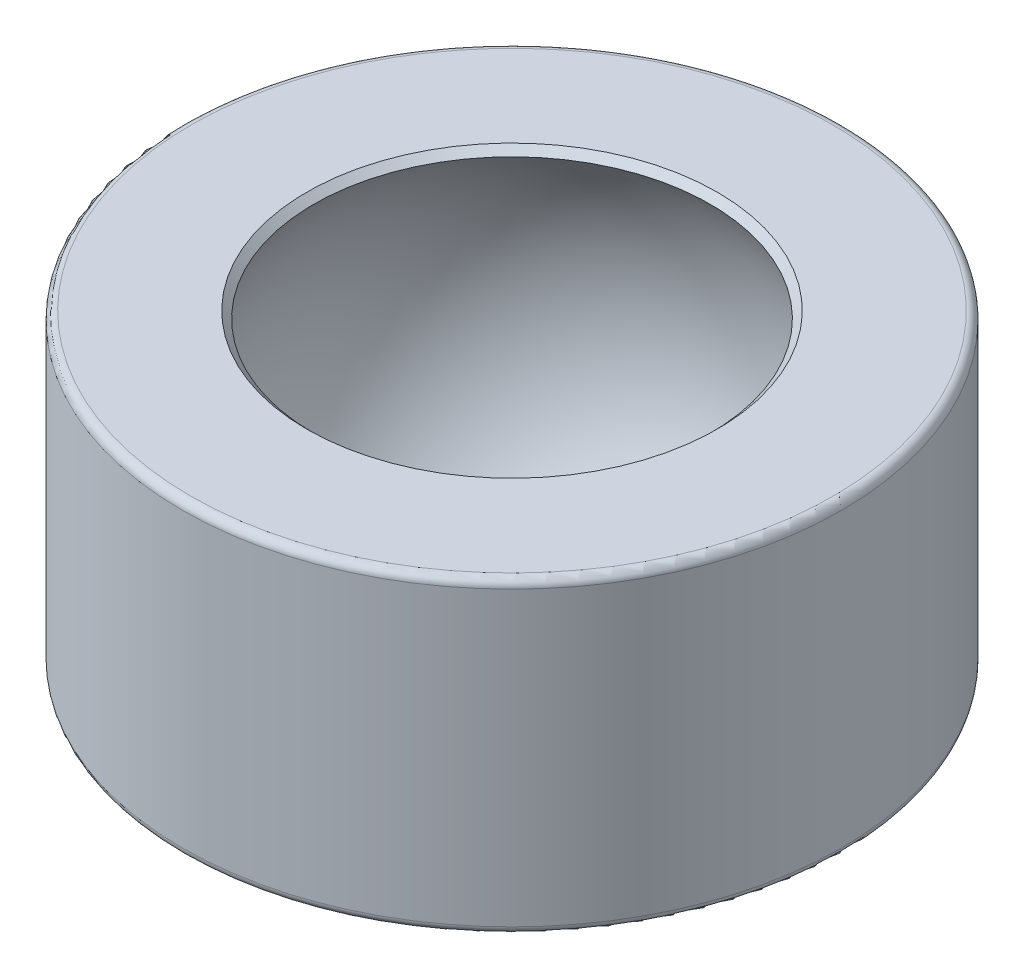
ISO-10303-21;
HEADER;
FILE_DESCRIPTION(('STEP AP214'),'2;1');
FILE_NAME('part.step','',(''),(''),'','','');
FILE_SCHEMA(('AUTOMOTIVE_DESIGN { 1 0 10303 214 1 1 1 1 }'));
ENDSEC;
DATA;
#1=APPLICATION_CONTEXT('core data for automotive mechanical design processes');
#2=APPLICATION_PROTOCOL_DEFINITION('international standard','automotive_design',2000,#1);
#3=PRODUCT_CONTEXT('',#1,'mechanical');
#4=PRODUCT('Part','Part','',(#3));
#5=PRODUCT_RELATED_PRODUCT_CATEGORY('part','',(#4));
#6=PRODUCT_DEFINITION_FORMATION('','',#4);
#7=PRODUCT_DEFINITION_CONTEXT('part definition',#1,'design');
#8=PRODUCT_DEFINITION('design','',#6,#7);
#9=PRODUCT_DEFINITION_SHAPE('','',#8);
#10=(LENGTH_UNIT() NAMED_UNIT(*) SI_UNIT(.MILLI.,.METRE.));
#11=(NAMED_UNIT(*) PLANE_ANGLE_UNIT() SI_UNIT($,.RADIAN.));
#12=(NAMED_UNIT(*) SI_UNIT($,.STERADIAN.) SOLID_ANGLE_UNIT());
#13=UNCERTAINTY_MEASURE_WITH_UNIT(LENGTH_MEASURE(1.E-05),#10,'distance_accuracy_value','');
#14=(GEOMETRIC_REPRESENTATION_CONTEXT(3) GLOBAL_UNCERTAINTY_ASSIGNED_CONTEXT((#13)) GLOBAL_UNIT_ASSIGNED_CONTEXT((#10,
#11,#12)) REPRESENTATION_CONTEXT('',''));
#15=CARTESIAN_POINT('',(0.,0.,0.));
#16=DIRECTION('',(0.,0.,1.));
#17=DIRECTION('',(1.,0.,0.));
#18=AXIS2_PLACEMENT_3D('',#15,#16,#17);
#19=CARTESIAN_POINT('',(0.,-1.875,0.));
#20=DIRECTION('',(0.,1.,0.));
#21=DIRECTION('',(0.,0.,1.));
#22=AXIS2_PLACEMENT_3D('',#19,#20,#21);
#23=CYLINDRICAL_SURFACE('',#22,4.);
#24=CARTESIAN_POINT('',(0.,1.775,0.));
#25=DIRECTION('',(0.,1.,0.));
#26=DIRECTION('',(0.,0.,1.));
#27=AXIS2_PLACEMENT_3D('',#24,#25,#26);
#28=CIRCLE('',#27,4.);
#29=CARTESIAN_POINT('',(0.,1.775,4.));
#30=VERTEX_POINT('',#29);
#31=EDGE_CURVE('E68',#30,#30,#28,.F.);
#32=ORIENTED_EDGE('',*,*,#31,.T.);
#33=EDGE_LOOP('',(#32));
#34=FACE_BOUND('',#33,.T.);
#35=CARTESIAN_POINT('',(0.,-1.775,0.));
#36=DIRECTION('',(0.,1.,0.));
#37=DIRECTION('',(0.,0.,1.));
#38=AXIS2_PLACEMENT_3D('',#35,#36,#37);
#39=CIRCLE('',#38,4.);
#40=CARTESIAN_POINT('',(0.,-1.775,4.));
#41=VERTEX_POINT('',#40);
#42=EDGE_CURVE('E71',#41,#41,#39,.T.);
#43=ORIENTED_EDGE('',*,*,#42,.T.);
#44=EDGE_LOOP('',(#43));
#45=FACE_BOUND('',#44,.T.);
#46=ADVANCED_FACE('F44',(#34,#45),#23,.T.);
#47=CARTESIAN_POINT('',(0.,-1.875,0.));
#48=DIRECTION('',(0.,1.,0.));
#49=DIRECTION('',(0.,0.,1.));
#50=AXIS2_PLACEMENT_3D('',#47,#48,#49);
#51=PLANE('',#50);
#52=CARTESIAN_POINT('',(0.,-1.875,0.));
#53=DIRECTION('',(0.,1.,0.));
#54=DIRECTION('',(0.,0.,1.));
#55=AXIS2_PLACEMENT_3D('',#52,#53,#54);
#56=CIRCLE('',#55,2.44858836354783);
#57=CARTESIAN_POINT('',(0.,-1.875,2.44858836354783));
#58=VERTEX_POINT('',#57);
#59=EDGE_CURVE('E10',#58,#58,#56,.T.);
#60=ORIENTED_EDGE('',*,*,#59,.T.);
#61=EDGE_LOOP('',(#60));
#62=FACE_BOUND('',#61,.T.);
#63=CARTESIAN_POINT('',(0.,-1.875,0.));
#64=DIRECTION('',(0.,1.,0.));
#65=DIRECTION('',(0.,0.,1.));
#66=AXIS2_PLACEMENT_3D('',#63,#64,#65);
#67=CIRCLE('',#66,3.9);
#68=CARTESIAN_POINT('',(0.,-1.875,3.9));
#69=VERTEX_POINT('',#68);
#70=EDGE_CURVE('E65',#69,#69,#67,.F.);
#71=ORIENTED_EDGE('',*,*,#70,.T.);
#72=EDGE_LOOP('',(#71));
#73=FACE_BOUND('',#72,.T.);
#74=ADVANCED_FACE('F98',(#62,#73),#51,.F.);
#75=CARTESIAN_POINT('',(0.,1.875,0.));
#76=DIRECTION('',(0.,1.,0.));
#77=DIRECTION('',(0.,0.,1.));
#78=AXIS2_PLACEMENT_3D('',#75,#76,#77);
#79=PLANE('',#78);
#80=CARTESIAN_POINT('',(0.,1.875,0.));
#81=DIRECTION('',(0.,1.,0.));
#82=DIRECTION('',(0.,0.,1.));
#83=AXIS2_PLACEMENT_3D('',#80,#81,#82);
#84=CIRCLE('',#83,2.4918742493994);
#85=CARTESIAN_POINT('',(0.,1.875,2.4918742493994));
#86=VERTEX_POINT('',#85);
#87=EDGE_CURVE('E52',#86,#86,#84,.F.);
#88=ORIENTED_EDGE('',*,*,#87,.T.);
#89=EDGE_LOOP('',(#88));
#90=FACE_BOUND('',#89,.T.);
#91=CARTESIAN_POINT('',(0.,1.875,0.));
#92=DIRECTION('',(0.,1.,0.));
#93=DIRECTION('',(0.,0.,1.));
#94=AXIS2_PLACEMENT_3D('',#91,#92,#93);
#95=CIRCLE('',#94,3.9);
#96=CARTESIAN_POINT('',(0.,1.875,3.9));
#97=VERTEX_POINT('',#96);
#98=EDGE_CURVE('E74',#97,#97,#95,.T.);
#99=ORIENTED_EDGE('',*,*,#98,.T.);
#100=EDGE_LOOP('',(#99));
#101=FACE_BOUND('',#100,.T.);
#102=ADVANCED_FACE('F78',(#90,#101),#79,.T.);
#103=CARTESIAN_POINT('',(0.,0.,0.));
#104=DIRECTION('',(0.,0.,-1.));
#105=DIRECTION('',(1.,0.,0.));
#106=AXIS2_PLACEMENT_3D('',#103,#104,#105);
#107=SPHERICAL_SURFACE('',#106,3.);
#108=CARTESIAN_POINT('',(0.,0.,0.));
#109=DIRECTION('',(0.,-1.,0.));
#110=DIRECTION('',(0.,0.,-1.));
#111=AXIS2_PLACEMENT_3D('',#108,#109,#110);
#112=SPHERICAL_SURFACE('',#111,3.);
#113=CARTESIAN_POINT('',(0.,1.79034026704698,0.));
#114=DIRECTION('',(0.,-1.,0.));
#115=DIRECTION('',(0.,0.,-1.));
#116=AXIS2_PLACEMENT_3D('',#113,#114,#115);
#117=CIRCLE('',#116,2.40721451644638);
#118=CARTESIAN_POINT('',(0.,1.79034026704698,2.40721451644638));
#119=VERTEX_POINT('',#118);
#120=EDGE_CURVE('E56',#119,#119,#117,.F.);
#121=ORIENTED_EDGE('',*,*,#120,.T.);
#122=EDGE_LOOP('',(#121));
#123=FACE_BOUND('',#122,.T.);
#124=CARTESIAN_POINT('',(0.,-1.75235006248991,0.));
#125=DIRECTION('',(0.,1.,0.));
#126=DIRECTION('',(0.,0.,1.));
#127=AXIS2_PLACEMENT_3D('',#124,#125,#126);
#128=CIRCLE('',#127,2.43500908796899);
#129=CARTESIAN_POINT('',(0.,-1.75235006248991,2.43500908796899));
#130=VERTEX_POINT('',#129);
#131=EDGE_CURVE('E60',#130,#130,#128,.F.);
#132=ORIENTED_EDGE('',*,*,#131,.T.);
#133=EDGE_LOOP('',(#132));
#134=FACE_BOUND('',#133,.T.);
#135=ADVANCED_FACE('F83',(#123,#134),#112,.F.);
#136=CARTESIAN_POINT('',(0.,1.775,0.));
#137=DIRECTION('',(0.,1.,0.));
#138=DIRECTION('',(0.,0.,1.));
#139=AXIS2_PLACEMENT_3D('',#136,#137,#138);
#140=TOROIDAL_SURFACE('',#139,3.9,0.1);
#141=ORIENTED_EDGE('',*,*,#31,.F.);
#142=EDGE_LOOP('',(#141));
#143=FACE_BOUND('',#142,.T.);
#144=ORIENTED_EDGE('',*,*,#98,.F.);
#145=EDGE_LOOP('',(#144));
#146=FACE_BOUND('',#145,.T.);
#147=ADVANCED_FACE('F80',(#143,#146),#140,.T.);
#148=CARTESIAN_POINT('',(0.,-1.775,0.));
#149=DIRECTION('',(0.,1.,0.));
#150=DIRECTION('',(0.,0.,1.));
#151=AXIS2_PLACEMENT_3D('',#148,#149,#150);
#152=TOROIDAL_SURFACE('',#151,3.9,0.1);
#153=ORIENTED_EDGE('',*,*,#70,.F.);
#154=EDGE_LOOP('',(#153));
#155=FACE_BOUND('',#154,.T.);
#156=ORIENTED_EDGE('',*,*,#42,.F.);
#157=EDGE_LOOP('',(#156));
#158=FACE_BOUND('',#157,.T.);
#159=ADVANCED_FACE('F82',(#155,#158),#152,.T.);
#160=CARTESIAN_POINT('',(0.,1.79034026704698,0.));
#161=DIRECTION('',(0.,1.,0.));
#162=DIRECTION('',(0.,0.,1.));
#163=AXIS2_PLACEMENT_3D('',#160,#161,#162);
#164=CONICAL_SURFACE('',#163,2.40721451644638,0.785398163397448);
#165=CARTESIAN_POINT('',(0.,1.875,2.4918742493994));
#166=CARTESIAN_POINT('',(0.,1.87411812778174,2.49099237718114));
#167=CARTESIAN_POINT('',(0.,1.87323625556348,2.49011050496288));
#168=CARTESIAN_POINT('',(0.,1.87147251112696,2.48834676052636));
#169=CARTESIAN_POINT('',(0.,1.8705906389087,2.4874648883081));
#170=CARTESIAN_POINT('',(0.,1.86882689447218,2.48570114387158));
#171=CARTESIAN_POINT('',(0.,1.86794502225391,2.48481927165331));
#172=CARTESIAN_POINT('',(0.,1.86618127781739,2.48305552721679));
#173=CARTESIAN_POINT('',(0.,1.86529940559913,2.48217365499853));
#174=CARTESIAN_POINT('',(0.,1.86353566116261,2.48040991056201));
#175=CARTESIAN_POINT('',(0.,1.86265378894435,2.47952803834375));
#176=CARTESIAN_POINT('',(0.,1.86089004450783,2.47776429390723));
#177=CARTESIAN_POINT('',(0.,1.86000817228957,2.47688242168897));
#178=CARTESIAN_POINT('',(0.,1.85824442785305,2.47511867725245));
#179=CARTESIAN_POINT('',(0.,1.85736255563479,2.47423680503419));
#180=CARTESIAN_POINT('',(0.,1.85559881119827,2.47247306059767));
#181=CARTESIAN_POINT('',(0.,1.85471693898,2.47159118837941));
#182=CARTESIAN_POINT('',(0.,1.85295319454348,2.46982744394288));
#183=CARTESIAN_POINT('',(0.,1.85207132232522,2.46894557172462));
#184=CARTESIAN_POINT('',(0.,1.8503075778887,2.4671818272881));
#185=CARTESIAN_POINT('',(0.,1.84942570567044,2.46629995506984));
#186=CARTESIAN_POINT('',(0.,1.84766196123392,2.46453621063332));
#187=CARTESIAN_POINT('',(0.,1.84678008901566,2.46365433841506));
#188=CARTESIAN_POINT('',(0.,1.84501634457914,2.46189059397854));
#189=CARTESIAN_POINT('',(0.,1.84413447236088,2.46100872176028));
#190=CARTESIAN_POINT('',(0.,1.84237072792436,2.45924497732376));
#191=CARTESIAN_POINT('',(0.,1.84148885570609,2.45836310510549));
#192=CARTESIAN_POINT('',(0.,1.83972511126957,2.45659936066897));
#193=CARTESIAN_POINT('',(0.,1.83884323905131,2.45571748845071));
#194=CARTESIAN_POINT('',(0.,1.83707949461479,2.45395374401419));
#195=CARTESIAN_POINT('',(0.,1.83619762239653,2.45307187179593));
#196=CARTESIAN_POINT('',(0.,1.83443387796001,2.45130812735941));
#197=CARTESIAN_POINT('',(0.,1.83355200574175,2.45042625514115));
#198=CARTESIAN_POINT('',(0.,1.83178826130523,2.44866251070463));
#199=CARTESIAN_POINT('',(0.,1.83090638908697,2.44778063848637));
#200=CARTESIAN_POINT('',(0.,1.82914264465045,2.44601689404985));
#201=CARTESIAN_POINT('',(0.,1.82826077243218,2.44513502183159));
#202=CARTESIAN_POINT('',(0.,1.82649702799566,2.44337127739506));
#203=CARTESIAN_POINT('',(0.,1.8256151557774,2.4424894051768));
#204=CARTESIAN_POINT('',(0.,1.82385141134088,2.44072566074028));
#205=CARTESIAN_POINT('',(0.,1.82296953912262,2.43984378852202));
#206=CARTESIAN_POINT('',(0.,1.8212057946861,2.4380800440855));
#207=CARTESIAN_POINT('',(0.,1.82032392246784,2.43719817186724));
#208=CARTESIAN_POINT('',(0.,1.81856017803132,2.43543442743072));
#209=CARTESIAN_POINT('',(0.,1.81767830581306,2.43455255521246));
#210=CARTESIAN_POINT('',(0.,1.81591456137654,2.43278881077594));
#211=CARTESIAN_POINT('',(0.,1.81503268915827,2.43190693855767));
#212=CARTESIAN_POINT('',(0.,1.81326894472175,2.43014319412115));
#213=CARTESIAN_POINT('',(0.,1.81238707250349,2.42926132190289));
#214=CARTESIAN_POINT('',(0.,1.81062332806697,2.42749757746637));
#215=CARTESIAN_POINT('',(0.,1.80974145584871,2.42661570524811));
#216=CARTESIAN_POINT('',(0.,1.80797771141219,2.42485196081159));
#217=CARTESIAN_POINT('',(0.,1.80709583919393,2.42397008859333));
#218=CARTESIAN_POINT('',(0.,1.80533209475741,2.42220634415681));
#219=CARTESIAN_POINT('',(0.,1.80445022253915,2.42132447193855));
#220=CARTESIAN_POINT('',(0.,1.80268647810263,2.41956072750203));
#221=CARTESIAN_POINT('',(0.,1.80180460588436,2.41867885528377));
#222=CARTESIAN_POINT('',(0.,1.80004086144784,2.41691511084724));
#223=CARTESIAN_POINT('',(0.,1.79915898922958,2.41603323862898));
#224=CARTESIAN_POINT('',(0.,1.79739524479306,2.41426949419246));
#225=CARTESIAN_POINT('',(0.,1.7965133725748,2.4133876219742));
#226=CARTESIAN_POINT('',(0.,1.79474962813828,2.41162387753768));
#227=CARTESIAN_POINT('',(0.,1.79386775592002,2.41074200531942));
#228=CARTESIAN_POINT('',(0.,1.7921040114835,2.4089782608829));
#229=CARTESIAN_POINT('',(0.,1.79122213926524,2.40809638866464));
#230=CARTESIAN_POINT('',(0.,1.79034026704698,2.40721451644638));
#231=B_SPLINE_CURVE_WITH_KNOTS('',3,(#165,#166,#167,#168,#169,#170,#171,#172,#173,#174,#175,
#176,#177,#178,#179,#180,#181,#182,#183,#184,#185,#186,#187,#188,#189,#190,#191,#192,#193,#194,
#195,#196,#197,#198,#199,#200,#201,#202,#203,#204,#205,#206,#207,#208,#209,#210,#211,#212,#213,
#214,#215,#216,#217,#218,#219,#220,#221,#222,#223,#224,#225,#226,#227,#228,#229,#230),
.UNSPECIFIED.,.F.,.F.,(4,2,2,2,2,2,2,2,2,2,2,2,2,2,2,2,2,2,2,2,2,2,2,2,2,2,2,2,2,2,2,2,4),(0.,
0.00374146695403291,0.00748293390806566,0.0112244008620984,0.0149658678161315,
0.0187073347701641,0.0224488017241968,0.0261902686782299,0.0299317356322627,0.0336732025862956,
0.0374146695403283,0.0411561364943611,0.0448976034483941,0.0486390704024267,0.0523805373564598,
0.0561220043104926,0.0598634712645253,0.0636049382185582,0.067346405172591,0.0710878721266237,
0.0748293390806568,0.0785708060346894,0.0823122729887221,0.0860537399427552,0.0897952068967879,
0.0935366738508209,0.0972781408048536,0.101019607758886,0.104761074712919,0.108502541666952,
0.112244008620985,0.115985475575018,0.11972694252905),.UNSPECIFIED.);
#232=EDGE_CURVE('BSEAM90',#86,#119,#231,.T.);
#233=ORIENTED_EDGE('',*,*,#87,.F.);
#234=ORIENTED_EDGE('',*,*,#120,.F.);
#235=ORIENTED_EDGE('',*,*,#232,.T.);
#236=ORIENTED_EDGE('',*,*,#232,.F.);
#237=EDGE_LOOP('',(#233,#235,#234,#236));
#238=FACE_BOUND('',#237,.T.);
#239=ADVANCED_FACE('F90',(#238),#164,.F.);
#240=CARTESIAN_POINT('',(0.,-1.875,0.));
#241=DIRECTION('',(0.,-1.,0.));
#242=DIRECTION('',(0.,0.,-1.));
#243=AXIS2_PLACEMENT_3D('',#240,#241,#242);
#244=CONICAL_SURFACE('',#243,2.44858836354783,0.11026663046042);
#245=ORIENTED_EDGE('',*,*,#131,.F.);
#246=EDGE_LOOP('',(#245));
#247=FACE_BOUND('',#246,.T.);
#248=ORIENTED_EDGE('',*,*,#59,.F.);
#249=EDGE_LOOP('',(#248));
#250=FACE_BOUND('',#249,.T.);
#251=ADVANCED_FACE('F47',(#247,#250),#244,.F.);
#252=CLOSED_SHELL('',(#46,#74,#102,#135,#147,#159,#239,#251));
#253=MANIFOLD_SOLID_BREP('B2',#252);
#254=ADVANCED_BREP_SHAPE_REPRESENTATION('',(#18,#253),#14);
#255=SHAPE_DEFINITION_REPRESENTATION(#9,#254);
ENDSEC;
END-ISO-10303-21;
